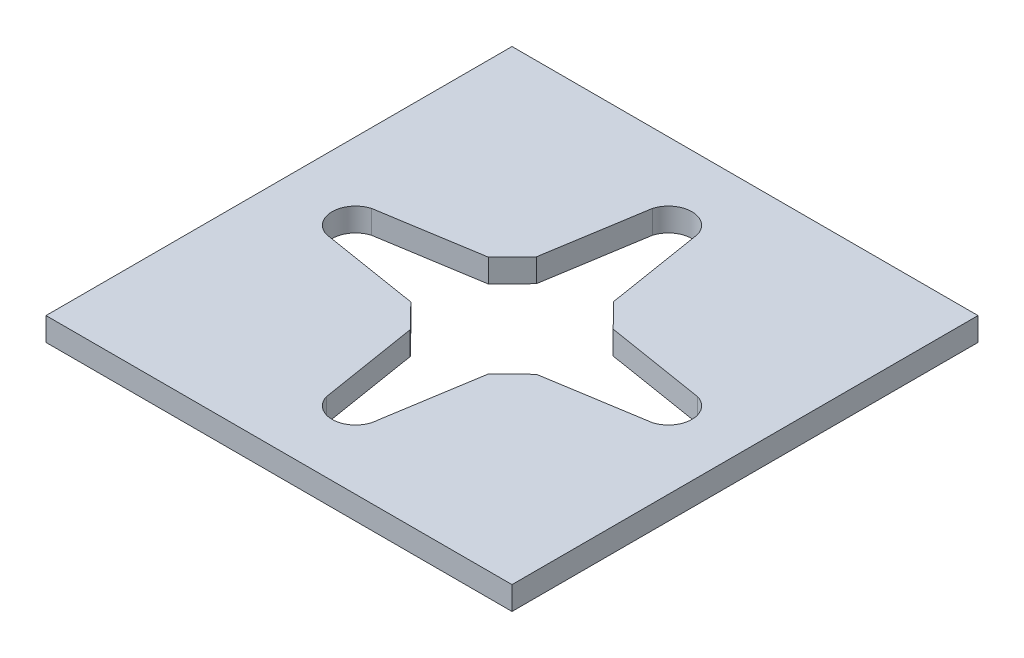
ISO-10303-21;
HEADER;
FILE_DESCRIPTION(('STEP AP214'),'2;1');
FILE_NAME('part.step','',(''),(''),'','','');
FILE_SCHEMA(('AUTOMOTIVE_DESIGN { 1 0 10303 214 1 1 1 1 }'));
ENDSEC;
DATA;
#1=APPLICATION_CONTEXT('core data for automotive mechanical design processes');
#2=APPLICATION_PROTOCOL_DEFINITION('international standard','automotive_design',2000,#1);
#3=PRODUCT_CONTEXT('',#1,'mechanical');
#4=PRODUCT('Part','Part','',(#3));
#5=PRODUCT_RELATED_PRODUCT_CATEGORY('part','',(#4));
#6=PRODUCT_DEFINITION_FORMATION('','',#4);
#7=PRODUCT_DEFINITION_CONTEXT('part definition',#1,'design');
#8=PRODUCT_DEFINITION('design','',#6,#7);
#9=PRODUCT_DEFINITION_SHAPE('','',#8);
#10=(LENGTH_UNIT() NAMED_UNIT(*) SI_UNIT(.MILLI.,.METRE.));
#11=(NAMED_UNIT(*) PLANE_ANGLE_UNIT() SI_UNIT($,.RADIAN.));
#12=(NAMED_UNIT(*) SI_UNIT($,.STERADIAN.) SOLID_ANGLE_UNIT());
#13=UNCERTAINTY_MEASURE_WITH_UNIT(LENGTH_MEASURE(1.E-05),#10,'distance_accuracy_value','');
#14=(GEOMETRIC_REPRESENTATION_CONTEXT(3) GLOBAL_UNCERTAINTY_ASSIGNED_CONTEXT((#13)) GLOBAL_UNIT_ASSIGNED_CONTEXT((#10,
#11,#12)) REPRESENTATION_CONTEXT('',''));
#15=CARTESIAN_POINT('',(0.,0.,0.));
#16=DIRECTION('',(0.,0.,1.));
#17=DIRECTION('',(1.,0.,0.));
#18=AXIS2_PLACEMENT_3D('',#15,#16,#17);
#19=CARTESIAN_POINT('',(25.4,2.54,25.4));
#20=DIRECTION('',(-1.,0.,0.));
#21=DIRECTION('',(0.,0.,1.));
#22=AXIS2_PLACEMENT_3D('',#19,#20,#21);
#23=PLANE('',#22);
#24=DIRECTION('',(0.,0.,-1.));
#25=VECTOR('',#24,1.);
#26=CARTESIAN_POINT('',(25.4,0.,25.4));
#27=LINE('',#26,#25);
#28=CARTESIAN_POINT('',(25.4,0.,25.4));
#29=VERTEX_POINT('',#28);
#30=CARTESIAN_POINT('',(25.4,0.,-25.4));
#31=VERTEX_POINT('',#30);
#32=EDGE_CURVE('E269',#29,#31,#27,.T.);
#33=ORIENTED_EDGE('',*,*,#32,.T.);
#34=DIRECTION('',(0.,-1.,0.));
#35=VECTOR('',#34,1.);
#36=CARTESIAN_POINT('',(25.4,2.54,-25.4));
#37=LINE('',#36,#35);
#38=CARTESIAN_POINT('',(25.4,2.54,-25.4));
#39=VERTEX_POINT('',#38);
#40=EDGE_CURVE('E11',#39,#31,#37,.T.);
#41=ORIENTED_EDGE('',*,*,#40,.F.);
#42=DIRECTION('',(0.,0.,-1.));
#43=VECTOR('',#42,1.);
#44=CARTESIAN_POINT('',(25.4,2.54,25.4));
#45=LINE('',#44,#43);
#46=CARTESIAN_POINT('',(25.4,2.54,25.4));
#47=VERTEX_POINT('',#46);
#48=EDGE_CURVE('E297',#47,#39,#45,.T.);
#49=ORIENTED_EDGE('',*,*,#48,.F.);
#50=DIRECTION('',(0.,-1.,0.));
#51=VECTOR('',#50,1.);
#52=CARTESIAN_POINT('',(25.4,2.54,25.4));
#53=LINE('',#52,#51);
#54=EDGE_CURVE('E307',#47,#29,#53,.T.);
#55=ORIENTED_EDGE('',*,*,#54,.T.);
#56=EDGE_LOOP('',(#33,#41,#49,#55));
#57=FACE_BOUND('',#56,.T.);
#58=ADVANCED_FACE('F34',(#57),#23,.F.);
#59=CARTESIAN_POINT('',(-25.4,2.54,-25.4));
#60=DIRECTION('',(0.,0.,1.));
#61=DIRECTION('',(1.,0.,0.));
#62=AXIS2_PLACEMENT_3D('',#59,#60,#61);
#63=PLANE('',#62);
#64=DIRECTION('',(-1.,0.,0.));
#65=VECTOR('',#64,1.);
#66=CARTESIAN_POINT('',(-25.4,0.,-25.4));
#67=LINE('',#66,#65);
#68=CARTESIAN_POINT('',(-25.4,0.,-25.4));
#69=VERTEX_POINT('',#68);
#70=EDGE_CURVE('E310',#31,#69,#67,.T.);
#71=ORIENTED_EDGE('',*,*,#70,.T.);
#72=DIRECTION('',(0.,-1.,0.));
#73=VECTOR('',#72,1.);
#74=CARTESIAN_POINT('',(-25.4,2.54,-25.4));
#75=LINE('',#74,#73);
#76=CARTESIAN_POINT('',(-25.4,2.54,-25.4));
#77=VERTEX_POINT('',#76);
#78=EDGE_CURVE('E41',#77,#69,#75,.T.);
#79=ORIENTED_EDGE('',*,*,#78,.F.);
#80=DIRECTION('',(-1.,0.,0.));
#81=VECTOR('',#80,1.);
#82=CARTESIAN_POINT('',(-25.4,2.54,-25.4));
#83=LINE('',#82,#81);
#84=EDGE_CURVE('E300',#39,#77,#83,.T.);
#85=ORIENTED_EDGE('',*,*,#84,.F.);
#86=ORIENTED_EDGE('',*,*,#40,.T.);
#87=EDGE_LOOP('',(#71,#79,#85,#86));
#88=FACE_BOUND('',#87,.T.);
#89=ADVANCED_FACE('F338',(#88),#63,.F.);
#90=CARTESIAN_POINT('',(-25.4,2.54,25.4));
#91=DIRECTION('',(1.,0.,0.));
#92=DIRECTION('',(0.,0.,-1.));
#93=AXIS2_PLACEMENT_3D('',#90,#91,#92);
#94=PLANE('',#93);
#95=DIRECTION('',(0.,0.,1.));
#96=VECTOR('',#95,1.);
#97=CARTESIAN_POINT('',(-25.4,0.,25.4));
#98=LINE('',#97,#96);
#99=CARTESIAN_POINT('',(-25.4,0.,25.4));
#100=VERTEX_POINT('',#99);
#101=EDGE_CURVE('E312',#69,#100,#98,.T.);
#102=ORIENTED_EDGE('',*,*,#101,.T.);
#103=DIRECTION('',(0.,-1.,0.));
#104=VECTOR('',#103,1.);
#105=CARTESIAN_POINT('',(-25.4,2.54,25.4));
#106=LINE('',#105,#104);
#107=CARTESIAN_POINT('',(-25.4,2.54,25.4));
#108=VERTEX_POINT('',#107);
#109=EDGE_CURVE('E317',#108,#100,#106,.T.);
#110=ORIENTED_EDGE('',*,*,#109,.F.);
#111=DIRECTION('',(0.,0.,1.));
#112=VECTOR('',#111,1.);
#113=CARTESIAN_POINT('',(-25.4,2.54,25.4));
#114=LINE('',#113,#112);
#115=EDGE_CURVE('E303',#77,#108,#114,.T.);
#116=ORIENTED_EDGE('',*,*,#115,.F.);
#117=ORIENTED_EDGE('',*,*,#78,.T.);
#118=EDGE_LOOP('',(#102,#110,#116,#117));
#119=FACE_BOUND('',#118,.T.);
#120=ADVANCED_FACE('F324',(#119),#94,.F.);
#121=CARTESIAN_POINT('',(-25.4,2.54,25.4));
#122=DIRECTION('',(0.,0.,-1.));
#123=DIRECTION('',(-1.,0.,0.));
#124=AXIS2_PLACEMENT_3D('',#121,#122,#123);
#125=PLANE('',#124);
#126=DIRECTION('',(1.,0.,0.));
#127=VECTOR('',#126,1.);
#128=CARTESIAN_POINT('',(-25.4,0.,25.4));
#129=LINE('',#128,#127);
#130=EDGE_CURVE('E301',#100,#29,#129,.T.);
#131=ORIENTED_EDGE('',*,*,#130,.T.);
#132=ORIENTED_EDGE('',*,*,#54,.F.);
#133=DIRECTION('',(1.,0.,0.));
#134=VECTOR('',#133,1.);
#135=CARTESIAN_POINT('',(-25.4,2.54,25.4));
#136=LINE('',#135,#134);
#137=EDGE_CURVE('E305',#108,#47,#136,.T.);
#138=ORIENTED_EDGE('',*,*,#137,.F.);
#139=ORIENTED_EDGE('',*,*,#109,.T.);
#140=EDGE_LOOP('',(#131,#132,#138,#139));
#141=FACE_BOUND('',#140,.T.);
#142=ADVANCED_FACE('F333',(#141),#125,.F.);
#143=CARTESIAN_POINT('',(0.,2.54,0.));
#144=DIRECTION('',(0.,-1.,0.));
#145=DIRECTION('',(0.,0.,-1.));
#146=AXIS2_PLACEMENT_3D('',#143,#144,#145);
#147=PLANE('',#146);
#148=DIRECTION('',(0.159059701123281,0.,0.987268966127556));
#149=VECTOR('',#148,1.);
#150=CARTESIAN_POINT('',(-4.2146166189501,2.54,6.87754055348759));
#151=LINE('',#150,#149);
#152=CARTESIAN_POINT('',(-4.2146166189501,2.54,6.87754055348759));
#153=VERTEX_POINT('',#152);
#154=CARTESIAN_POINT('',(-2.46184494954487,2.54,17.7568334334004));
#155=VERTEX_POINT('',#154);
#156=EDGE_CURVE('E179',#153,#155,#151,.T.);
#157=ORIENTED_EDGE('',*,*,#156,.F.);
#158=DIRECTION('',(-0.698247442953113,0.,-0.715856485903033));
#159=VECTOR('',#158,1.);
#160=CARTESIAN_POINT('',(-4.2146166189501,2.54,6.87754055348759));
#161=LINE('',#160,#159);
#162=CARTESIAN_POINT('',(-6.79982336512669,2.54,4.22713769798433));
#163=VERTEX_POINT('',#162);
#164=EDGE_CURVE('E173',#153,#163,#161,.T.);
#165=ORIENTED_EDGE('',*,*,#164,.T.);
#166=DIRECTION('',(-0.987268966127555,0.,-0.159059701123284));
#167=VECTOR('',#166,1.);
#168=CARTESIAN_POINT('',(-6.79982336512669,2.54,4.22713769798433));
#169=LINE('',#168,#167);
#170=CARTESIAN_POINT('',(-17.7568334334004,2.54,2.46184494954473));
#171=VERTEX_POINT('',#170);
#172=EDGE_CURVE('E182',#163,#171,#169,.T.);
#173=ORIENTED_EDGE('',*,*,#172,.T.);
#174=CARTESIAN_POINT('',(-17.0514508816668,2.54,0.));
#175=DIRECTION('',(0.,-1.,0.));
#176=DIRECTION('',(0.,0.,-1.));
#177=AXIS2_PLACEMENT_3D('',#174,#175,#176);
#178=CIRCLE('',#177,2.5609070853682);
#179=CARTESIAN_POINT('',(-17.7568334334004,2.54,-2.46184494954474));
#180=VERTEX_POINT('',#179);
#181=EDGE_CURVE('E48',#171,#180,#178,.T.);
#182=ORIENTED_EDGE('',*,*,#181,.T.);
#183=DIRECTION('',(-0.987268966127555,0.,0.159059701123284));
#184=VECTOR('',#183,1.);
#185=CARTESIAN_POINT('',(-6.79982336512669,2.54,-4.22713769798433));
#186=LINE('',#185,#184);
#187=CARTESIAN_POINT('',(-6.79982336512669,2.54,-4.22713769798433));
#188=VERTEX_POINT('',#187);
#189=EDGE_CURVE('E196',#188,#180,#186,.T.);
#190=ORIENTED_EDGE('',*,*,#189,.F.);
#191=DIRECTION('',(0.698247442953232,0.,-0.715856485902917));
#192=VECTOR('',#191,1.);
#193=CARTESIAN_POINT('',(-6.79982336512669,2.54,-4.22713769798433));
#194=LINE('',#193,#192);
#195=CARTESIAN_POINT('',(-4.21461661895082,2.54,-6.87754055348598));
#196=VERTEX_POINT('',#195);
#197=EDGE_CURVE('E198',#188,#196,#194,.T.);
#198=ORIENTED_EDGE('',*,*,#197,.T.);
#199=DIRECTION('',(0.15905970112314,0.,-0.987268966127578));
#200=VECTOR('',#199,1.);
#201=CARTESIAN_POINT('',(-4.21461661895082,2.54,-6.87754055348598));
#202=LINE('',#201,#200);
#203=CARTESIAN_POINT('',(-2.46184494954694,2.54,-17.756833433399));
#204=VERTEX_POINT('',#203);
#205=EDGE_CURVE('E201',#196,#204,#202,.T.);
#206=ORIENTED_EDGE('',*,*,#205,.T.);
#207=CARTESIAN_POINT('',(-2.15060913565076E-12,2.54,-17.0514508816658));
#208=DIRECTION('',(0.,-1.,0.));
#209=DIRECTION('',(0.,0.,-1.));
#210=AXIS2_PLACEMENT_3D('',#207,#208,#209);
#211=CIRCLE('',#210,2.56090708536816);
#212=CARTESIAN_POINT('',(2.46184494954242,2.54,-17.7568334333998));
#213=VERTEX_POINT('',#212);
#214=EDGE_CURVE('E204',#204,#213,#211,.T.);
#215=ORIENTED_EDGE('',*,*,#214,.T.);
#216=DIRECTION('',(-0.159059701123438,0.,-0.98726896612753));
#217=VECTOR('',#216,1.);
#218=CARTESIAN_POINT('',(4.21461661894958,2.54,-6.87754055348723));
#219=LINE('',#218,#217);
#220=CARTESIAN_POINT('',(4.21461661894958,2.54,-6.87754055348723));
#221=VERTEX_POINT('',#220);
#222=EDGE_CURVE('E207',#221,#213,#219,.T.);
#223=ORIENTED_EDGE('',*,*,#222,.F.);
#224=DIRECTION('',(-0.698247442953113,0.,-0.715856485903033));
#225=VECTOR('',#224,1.);
#226=CARTESIAN_POINT('',(6.79982336512564,2.54,-4.22713769798451));
#227=LINE('',#226,#225);
#228=CARTESIAN_POINT('',(6.79982336512564,2.54,-4.22713769798451));
#229=VERTEX_POINT('',#228);
#230=EDGE_CURVE('E209',#229,#221,#227,.T.);
#231=ORIENTED_EDGE('',*,*,#230,.F.);
#232=DIRECTION('',(0.987268966127582,0.,0.159059701123118));
#233=VECTOR('',#232,1.);
#234=CARTESIAN_POINT('',(6.79982336512564,2.54,-4.22713769798451));
#235=LINE('',#234,#233);
#236=CARTESIAN_POINT('',(17.7568334333996,2.54,-2.46184494954675));
#237=VERTEX_POINT('',#236);
#238=EDGE_CURVE('E211',#229,#237,#235,.T.);
#239=ORIENTED_EDGE('',*,*,#238,.T.);
#240=CARTESIAN_POINT('',(17.0514508816528,2.54,-5.60074017291797E-12));
#241=DIRECTION('',(0.,1.,0.));
#242=DIRECTION('',(0.,0.,1.));
#243=AXIS2_PLACEMENT_3D('',#240,#241,#242);
#244=CIRCLE('',#243,2.56090708536853);
#245=CARTESIAN_POINT('',(17.7568334333989,2.54,2.46184494953587));
#246=VERTEX_POINT('',#245);
#247=EDGE_CURVE('E214',#246,#237,#244,.T.);
#248=ORIENTED_EDGE('',*,*,#247,.F.);
#249=DIRECTION('',(0.987268966127428,0.,-0.159059701124071));
#250=VECTOR('',#249,1.);
#251=CARTESIAN_POINT('',(6.87754055348766,2.54,4.21461661895008));
#252=LINE('',#251,#250);
#253=CARTESIAN_POINT('',(6.87754055348766,2.54,4.21461661895008));
#254=VERTEX_POINT('',#253);
#255=EDGE_CURVE('E216',#254,#246,#252,.T.);
#256=ORIENTED_EDGE('',*,*,#255,.F.);
#257=DIRECTION('',(0.715856485903032,0.,-0.698247442953114));
#258=VECTOR('',#257,1.);
#259=CARTESIAN_POINT('',(4.2271376979843,2.54,6.79982336512676));
#260=LINE('',#259,#258);
#261=CARTESIAN_POINT('',(4.2271376979843,2.54,6.79982336512676));
#262=VERTEX_POINT('',#261);
#263=EDGE_CURVE('E218',#262,#254,#260,.T.);
#264=ORIENTED_EDGE('',*,*,#263,.F.);
#265=DIRECTION('',(-0.159059701123261,0.,0.987268966127559));
#266=VECTOR('',#265,1.);
#267=CARTESIAN_POINT('',(4.2271376979843,2.54,6.79982336512676));
#268=LINE('',#267,#266);
#269=CARTESIAN_POINT('',(2.55881473583303,2.54,17.154950869947));
#270=VERTEX_POINT('',#269);
#271=EDGE_CURVE('E220',#262,#270,#268,.T.);
#272=ORIENTED_EDGE('',*,*,#271,.T.);
#273=CARTESIAN_POINT('',(0.,2.54,17.0514508816668));
#274=DIRECTION('',(0.,1.,0.));
#275=DIRECTION('',(0.,0.,1.));
#276=AXIS2_PLACEMENT_3D('',#273,#274,#275);
#277=CIRCLE('',#276,2.56090708536849);
#278=EDGE_CURVE('E223',#155,#270,#277,.T.);
#279=ORIENTED_EDGE('',*,*,#278,.F.);
#280=EDGE_LOOP('',(#157,#165,#173,#182,#190,#198,#206,#215,#223,#231,#239,#248,#256,#264,#272,#279));
#281=FACE_BOUND('',#280,.T.);
#282=ORIENTED_EDGE('',*,*,#48,.T.);
#283=ORIENTED_EDGE('',*,*,#84,.T.);
#284=ORIENTED_EDGE('',*,*,#115,.T.);
#285=ORIENTED_EDGE('',*,*,#137,.T.);
#286=EDGE_LOOP('',(#282,#283,#284,#285));
#287=FACE_BOUND('',#286,.T.);
#288=ADVANCED_FACE('F186',(#281,#287),#147,.F.);
#289=CARTESIAN_POINT('',(0.,0.,0.));
#290=DIRECTION('',(0.,-1.,0.));
#291=DIRECTION('',(0.,0.,-1.));
#292=AXIS2_PLACEMENT_3D('',#289,#290,#291);
#293=PLANE('',#292);
#294=DIRECTION('',(-0.698247442953113,0.,-0.715856485903033));
#295=VECTOR('',#294,1.);
#296=CARTESIAN_POINT('',(-4.2146166189501,0.,6.87754055348759));
#297=LINE('',#296,#295);
#298=CARTESIAN_POINT('',(-4.2146166189501,0.,6.87754055348759));
#299=VERTEX_POINT('',#298);
#300=CARTESIAN_POINT('',(-6.79982336512669,0.,4.22713769798433));
#301=VERTEX_POINT('',#300);
#302=EDGE_CURVE('E56',#299,#301,#297,.T.);
#303=ORIENTED_EDGE('',*,*,#302,.F.);
#304=DIRECTION('',(0.159059701123281,0.,0.987268966127556));
#305=VECTOR('',#304,1.);
#306=CARTESIAN_POINT('',(-4.2146166189501,0.,6.87754055348759));
#307=LINE('',#306,#305);
#308=CARTESIAN_POINT('',(-2.46184494954487,0.,17.7568334334004));
#309=VERTEX_POINT('',#308);
#310=EDGE_CURVE('E189',#299,#309,#307,.T.);
#311=ORIENTED_EDGE('',*,*,#310,.T.);
#312=CARTESIAN_POINT('',(0.,0.,17.0514508816668));
#313=DIRECTION('',(0.,-1.,0.));
#314=DIRECTION('',(0.,0.,-1.));
#315=AXIS2_PLACEMENT_3D('',#312,#313,#314);
#316=CIRCLE('',#315,2.56090708536829);
#317=CARTESIAN_POINT('',(2.55881473583303,0.,17.154950869947));
#318=VERTEX_POINT('',#317);
#319=EDGE_CURVE('E192',#318,#309,#316,.T.);
#320=ORIENTED_EDGE('',*,*,#319,.F.);
#321=DIRECTION('',(-0.159059701123261,0.,0.987268966127559));
#322=VECTOR('',#321,1.);
#323=CARTESIAN_POINT('',(4.2271376979843,0.,6.79982336512676));
#324=LINE('',#323,#322);
#325=CARTESIAN_POINT('',(4.2271376979843,0.,6.79982336512676));
#326=VERTEX_POINT('',#325);
#327=EDGE_CURVE('E262',#326,#318,#324,.T.);
#328=ORIENTED_EDGE('',*,*,#327,.F.);
#329=DIRECTION('',(0.715856485903032,0.,-0.698247442953114));
#330=VECTOR('',#329,1.);
#331=CARTESIAN_POINT('',(4.2271376979843,0.,6.79982336512676));
#332=LINE('',#331,#330);
#333=CARTESIAN_POINT('',(6.87754055348766,0.,4.21461661895008));
#334=VERTEX_POINT('',#333);
#335=EDGE_CURVE('E259',#326,#334,#332,.T.);
#336=ORIENTED_EDGE('',*,*,#335,.T.);
#337=DIRECTION('',(0.987268966127428,0.,-0.159059701124071));
#338=VECTOR('',#337,1.);
#339=CARTESIAN_POINT('',(6.87754055348766,0.,4.21461661895008));
#340=LINE('',#339,#338);
#341=CARTESIAN_POINT('',(17.7568334333989,0.,2.46184494953587));
#342=VERTEX_POINT('',#341);
#343=EDGE_CURVE('E256',#334,#342,#340,.T.);
#344=ORIENTED_EDGE('',*,*,#343,.T.);
#345=CARTESIAN_POINT('',(17.0514508816528,0.,-5.60074017291797E-12));
#346=DIRECTION('',(0.,1.,0.));
#347=DIRECTION('',(0.,0.,1.));
#348=AXIS2_PLACEMENT_3D('',#345,#346,#347);
#349=CIRCLE('',#348,2.56090708536853);
#350=CARTESIAN_POINT('',(17.7568334333996,0.,-2.46184494954675));
#351=VERTEX_POINT('',#350);
#352=EDGE_CURVE('E253',#342,#351,#349,.T.);
#353=ORIENTED_EDGE('',*,*,#352,.T.);
#354=DIRECTION('',(0.987268966127582,0.,0.159059701123118));
#355=VECTOR('',#354,1.);
#356=CARTESIAN_POINT('',(6.79982336512564,0.,-4.22713769798451));
#357=LINE('',#356,#355);
#358=CARTESIAN_POINT('',(6.79982336512564,0.,-4.22713769798451));
#359=VERTEX_POINT('',#358);
#360=EDGE_CURVE('E250',#359,#351,#357,.T.);
#361=ORIENTED_EDGE('',*,*,#360,.F.);
#362=DIRECTION('',(-0.698247442953113,0.,-0.715856485903033));
#363=VECTOR('',#362,1.);
#364=CARTESIAN_POINT('',(6.79982336512564,0.,-4.22713769798451));
#365=LINE('',#364,#363);
#366=CARTESIAN_POINT('',(4.21461661894958,0.,-6.87754055348723));
#367=VERTEX_POINT('',#366);
#368=EDGE_CURVE('E247',#359,#367,#365,.T.);
#369=ORIENTED_EDGE('',*,*,#368,.T.);
#370=DIRECTION('',(-0.159059701123438,0.,-0.98726896612753));
#371=VECTOR('',#370,1.);
#372=CARTESIAN_POINT('',(4.21461661894958,0.,-6.87754055348723));
#373=LINE('',#372,#371);
#374=CARTESIAN_POINT('',(2.46184494954242,0.,-17.7568334333998));
#375=VERTEX_POINT('',#374);
#376=EDGE_CURVE('E244',#367,#375,#373,.T.);
#377=ORIENTED_EDGE('',*,*,#376,.T.);
#378=CARTESIAN_POINT('',(-2.15060913565076E-12,0.,-17.0514508816658));
#379=DIRECTION('',(0.,-1.,0.));
#380=DIRECTION('',(0.,0.,-1.));
#381=AXIS2_PLACEMENT_3D('',#378,#379,#380);
#382=CIRCLE('',#381,2.56090708536816);
#383=CARTESIAN_POINT('',(-2.46184494954694,0.,-17.756833433399));
#384=VERTEX_POINT('',#383);
#385=EDGE_CURVE('E241',#384,#375,#382,.T.);
#386=ORIENTED_EDGE('',*,*,#385,.F.);
#387=DIRECTION('',(0.15905970112314,0.,-0.987268966127578));
#388=VECTOR('',#387,1.);
#389=CARTESIAN_POINT('',(-4.21461661895082,0.,-6.87754055348598));
#390=LINE('',#389,#388);
#391=CARTESIAN_POINT('',(-4.21461661895082,0.,-6.87754055348598));
#392=VERTEX_POINT('',#391);
#393=EDGE_CURVE('E238',#392,#384,#390,.T.);
#394=ORIENTED_EDGE('',*,*,#393,.F.);
#395=DIRECTION('',(0.698247442953232,0.,-0.715856485902917));
#396=VECTOR('',#395,1.);
#397=CARTESIAN_POINT('',(-6.79982336512669,0.,-4.22713769798433));
#398=LINE('',#397,#396);
#399=CARTESIAN_POINT('',(-6.79982336512669,0.,-4.22713769798433));
#400=VERTEX_POINT('',#399);
#401=EDGE_CURVE('E235',#400,#392,#398,.T.);
#402=ORIENTED_EDGE('',*,*,#401,.F.);
#403=DIRECTION('',(-0.987268966127555,0.,0.159059701123284));
#404=VECTOR('',#403,1.);
#405=CARTESIAN_POINT('',(-6.79982336512669,0.,-4.22713769798433));
#406=LINE('',#405,#404);
#407=CARTESIAN_POINT('',(-17.7568334334004,0.,-2.46184494954474));
#408=VERTEX_POINT('',#407);
#409=EDGE_CURVE('E232',#400,#408,#406,.T.);
#410=ORIENTED_EDGE('',*,*,#409,.T.);
#411=CARTESIAN_POINT('',(-17.0514508816668,0.,0.));
#412=DIRECTION('',(0.,-1.,0.));
#413=DIRECTION('',(0.,0.,-1.));
#414=AXIS2_PLACEMENT_3D('',#411,#412,#413);
#415=CIRCLE('',#414,2.5609070853682);
#416=CARTESIAN_POINT('',(-17.7568334334004,0.,2.46184494954473));
#417=VERTEX_POINT('',#416);
#418=EDGE_CURVE('E229',#417,#408,#415,.T.);
#419=ORIENTED_EDGE('',*,*,#418,.F.);
#420=DIRECTION('',(-0.987268966127555,0.,-0.159059701123284));
#421=VECTOR('',#420,1.);
#422=CARTESIAN_POINT('',(-6.79982336512669,0.,4.22713769798433));
#423=LINE('',#422,#421);
#424=EDGE_CURVE('E227',#301,#417,#423,.T.);
#425=ORIENTED_EDGE('',*,*,#424,.F.);
#426=EDGE_LOOP('',(#303,#311,#320,#328,#336,#344,#353,#361,#369,#377,#386,#394,#402,#410,#419,#425));
#427=FACE_BOUND('',#426,.T.);
#428=ORIENTED_EDGE('',*,*,#32,.F.);
#429=ORIENTED_EDGE('',*,*,#130,.F.);
#430=ORIENTED_EDGE('',*,*,#101,.F.);
#431=ORIENTED_EDGE('',*,*,#70,.F.);
#432=EDGE_LOOP('',(#428,#429,#430,#431));
#433=FACE_BOUND('',#432,.T.);
#434=ADVANCED_FACE('F330',(#427,#433),#293,.T.);
#435=CARTESIAN_POINT('',(-4.2146166189501,2.54,6.87754055348759));
#436=DIRECTION('',(-0.715856485903033,0.,0.698247442953113));
#437=DIRECTION('',(0.698247442953113,0.,0.715856485903033));
#438=AXIS2_PLACEMENT_3D('',#435,#436,#437);
#439=PLANE('',#438);
#440=ORIENTED_EDGE('',*,*,#302,.T.);
#441=DIRECTION('',(0.,-1.,0.));
#442=VECTOR('',#441,1.);
#443=CARTESIAN_POINT('',(-6.79982336512669,2.54,4.22713769798433));
#444=LINE('',#443,#442);
#445=EDGE_CURVE('E169',#163,#301,#444,.T.);
#446=ORIENTED_EDGE('',*,*,#445,.F.);
#447=ORIENTED_EDGE('',*,*,#164,.F.);
#448=DIRECTION('',(0.,-1.,0.));
#449=VECTOR('',#448,1.);
#450=CARTESIAN_POINT('',(-4.2146166189501,2.54,6.87754055348759));
#451=LINE('',#450,#449);
#452=EDGE_CURVE('E267',#153,#299,#451,.T.);
#453=ORIENTED_EDGE('',*,*,#452,.T.);
#454=EDGE_LOOP('',(#440,#446,#447,#453));
#455=FACE_BOUND('',#454,.T.);
#456=ADVANCED_FACE('F171',(#455),#439,.F.);
#457=CARTESIAN_POINT('',(-4.2146166189501,2.54,6.87754055348759));
#458=DIRECTION('',(0.987268966127556,0.,-0.159059701123281));
#459=DIRECTION('',(-0.159059701123281,0.,-0.987268966127556));
#460=AXIS2_PLACEMENT_3D('',#457,#458,#459);
#461=PLANE('',#460);
#462=ORIENTED_EDGE('',*,*,#310,.F.);
#463=ORIENTED_EDGE('',*,*,#452,.F.);
#464=ORIENTED_EDGE('',*,*,#156,.T.);
#465=DIRECTION('',(0.,-1.,0.));
#466=VECTOR('',#465,1.);
#467=CARTESIAN_POINT('',(-2.46184494954487,2.54,17.7568334334004));
#468=LINE('',#467,#466);
#469=EDGE_CURVE('E270',#155,#309,#468,.T.);
#470=ORIENTED_EDGE('',*,*,#469,.T.);
#471=EDGE_LOOP('',(#462,#463,#464,#470));
#472=FACE_BOUND('',#471,.T.);
#473=ADVANCED_FACE('F355',(#472),#461,.T.);
#474=CARTESIAN_POINT('',(0.,2.54,17.0514508816668));
#475=DIRECTION('',(0.,-1.,0.));
#476=DIRECTION('',(0.,0.,-1.));
#477=AXIS2_PLACEMENT_3D('',#474,#475,#476);
#478=CYLINDRICAL_SURFACE('',#477,2.56090708536829);
#479=ORIENTED_EDGE('',*,*,#319,.T.);
#480=ORIENTED_EDGE('',*,*,#469,.F.);
#481=ORIENTED_EDGE('',*,*,#278,.T.);
#482=DIRECTION('',(0.,-1.,0.));
#483=VECTOR('',#482,1.);
#484=CARTESIAN_POINT('',(2.55881473583303,2.54,17.154950869947));
#485=LINE('',#484,#483);
#486=EDGE_CURVE('E272',#270,#318,#485,.T.);
#487=ORIENTED_EDGE('',*,*,#486,.T.);
#488=EDGE_LOOP('',(#479,#480,#481,#487));
#489=FACE_BOUND('',#488,.T.);
#490=ADVANCED_FACE('F404',(#489),#478,.F.);
#491=CARTESIAN_POINT('',(4.2271376979843,2.54,6.79982336512676));
#492=DIRECTION('',(0.987268966127559,0.,0.159059701123261));
#493=DIRECTION('',(0.159059701123261,0.,-0.987268966127559));
#494=AXIS2_PLACEMENT_3D('',#491,#492,#493);
#495=PLANE('',#494);
#496=ORIENTED_EDGE('',*,*,#327,.T.);
#497=ORIENTED_EDGE('',*,*,#486,.F.);
#498=ORIENTED_EDGE('',*,*,#271,.F.);
#499=DIRECTION('',(0.,-1.,0.));
#500=VECTOR('',#499,1.);
#501=CARTESIAN_POINT('',(4.2271376979843,2.54,6.79982336512676));
#502=LINE('',#501,#500);
#503=EDGE_CURVE('E274',#262,#326,#502,.T.);
#504=ORIENTED_EDGE('',*,*,#503,.T.);
#505=EDGE_LOOP('',(#496,#497,#498,#504));
#506=FACE_BOUND('',#505,.T.);
#507=ADVANCED_FACE('F400',(#506),#495,.F.);
#508=CARTESIAN_POINT('',(4.2271376979843,2.54,6.79982336512676));
#509=DIRECTION('',(-0.698247442953114,0.,-0.715856485903032));
#510=DIRECTION('',(-0.715856485903032,0.,0.698247442953114));
#511=AXIS2_PLACEMENT_3D('',#508,#509,#510);
#512=PLANE('',#511);
#513=ORIENTED_EDGE('',*,*,#335,.F.);
#514=ORIENTED_EDGE('',*,*,#503,.F.);
#515=ORIENTED_EDGE('',*,*,#263,.T.);
#516=DIRECTION('',(0.,-1.,0.));
#517=VECTOR('',#516,1.);
#518=CARTESIAN_POINT('',(6.87754055348766,2.54,4.21461661895008));
#519=LINE('',#518,#517);
#520=EDGE_CURVE('E276',#254,#334,#519,.T.);
#521=ORIENTED_EDGE('',*,*,#520,.T.);
#522=EDGE_LOOP('',(#513,#514,#515,#521));
#523=FACE_BOUND('',#522,.T.);
#524=ADVANCED_FACE('F396',(#523),#512,.T.);
#525=CARTESIAN_POINT('',(6.87754055348766,2.54,4.21461661895008));
#526=DIRECTION('',(-0.159059701124071,0.,-0.987268966127428));
#527=DIRECTION('',(-0.987268966127428,0.,0.159059701124071));
#528=AXIS2_PLACEMENT_3D('',#525,#526,#527);
#529=PLANE('',#528);
#530=ORIENTED_EDGE('',*,*,#343,.F.);
#531=ORIENTED_EDGE('',*,*,#520,.F.);
#532=ORIENTED_EDGE('',*,*,#255,.T.);
#533=DIRECTION('',(0.,-1.,0.));
#534=VECTOR('',#533,1.);
#535=CARTESIAN_POINT('',(17.7568334333989,2.54,2.46184494953587));
#536=LINE('',#535,#534);
#537=EDGE_CURVE('E278',#246,#342,#536,.T.);
#538=ORIENTED_EDGE('',*,*,#537,.T.);
#539=EDGE_LOOP('',(#530,#531,#532,#538));
#540=FACE_BOUND('',#539,.T.);
#541=ADVANCED_FACE('F392',(#540),#529,.T.);
#542=CARTESIAN_POINT('',(17.0514508816528,2.54,-5.60074017291797E-12));
#543=DIRECTION('',(0.,-1.,0.));
#544=DIRECTION('',(0.,0.,-1.));
#545=AXIS2_PLACEMENT_3D('',#542,#543,#544);
#546=CYLINDRICAL_SURFACE('',#545,2.56090708536853);
#547=ORIENTED_EDGE('',*,*,#352,.F.);
#548=ORIENTED_EDGE('',*,*,#537,.F.);
#549=ORIENTED_EDGE('',*,*,#247,.T.);
#550=DIRECTION('',(0.,-1.,0.));
#551=VECTOR('',#550,1.);
#552=CARTESIAN_POINT('',(17.7568334333996,2.54,-2.46184494954675));
#553=LINE('',#552,#551);
#554=EDGE_CURVE('E280',#237,#351,#553,.T.);
#555=ORIENTED_EDGE('',*,*,#554,.T.);
#556=EDGE_LOOP('',(#547,#548,#549,#555));
#557=FACE_BOUND('',#556,.T.);
#558=ADVANCED_FACE('F388',(#557),#546,.F.);
#559=CARTESIAN_POINT('',(6.79982336512564,2.54,-4.22713769798451));
#560=DIRECTION('',(0.159059701123118,0.,-0.987268966127582));
#561=DIRECTION('',(-0.987268966127582,0.,-0.159059701123118));
#562=AXIS2_PLACEMENT_3D('',#559,#560,#561);
#563=PLANE('',#562);
#564=ORIENTED_EDGE('',*,*,#360,.T.);
#565=ORIENTED_EDGE('',*,*,#554,.F.);
#566=ORIENTED_EDGE('',*,*,#238,.F.);
#567=DIRECTION('',(0.,-1.,0.));
#568=VECTOR('',#567,1.);
#569=CARTESIAN_POINT('',(6.79982336512564,2.54,-4.22713769798451));
#570=LINE('',#569,#568);
#571=EDGE_CURVE('E282',#229,#359,#570,.T.);
#572=ORIENTED_EDGE('',*,*,#571,.T.);
#573=EDGE_LOOP('',(#564,#565,#566,#572));
#574=FACE_BOUND('',#573,.T.);
#575=ADVANCED_FACE('F384',(#574),#563,.F.);
#576=CARTESIAN_POINT('',(6.79982336512564,2.54,-4.22713769798451));
#577=DIRECTION('',(-0.715856485903033,0.,0.698247442953113));
#578=DIRECTION('',(0.698247442953113,0.,0.715856485903033));
#579=AXIS2_PLACEMENT_3D('',#576,#577,#578);
#580=PLANE('',#579);
#581=ORIENTED_EDGE('',*,*,#368,.F.);
#582=ORIENTED_EDGE('',*,*,#571,.F.);
#583=ORIENTED_EDGE('',*,*,#230,.T.);
#584=DIRECTION('',(0.,-1.,0.));
#585=VECTOR('',#584,1.);
#586=CARTESIAN_POINT('',(4.21461661894958,2.54,-6.87754055348723));
#587=LINE('',#586,#585);
#588=EDGE_CURVE('E284',#221,#367,#587,.T.);
#589=ORIENTED_EDGE('',*,*,#588,.T.);
#590=EDGE_LOOP('',(#581,#582,#583,#589));
#591=FACE_BOUND('',#590,.T.);
#592=ADVANCED_FACE('F380',(#591),#580,.T.);
#593=CARTESIAN_POINT('',(4.21461661894958,2.54,-6.87754055348723));
#594=DIRECTION('',(-0.98726896612753,0.,0.159059701123438));
#595=DIRECTION('',(0.159059701123438,0.,0.98726896612753));
#596=AXIS2_PLACEMENT_3D('',#593,#594,#595);
#597=PLANE('',#596);
#598=ORIENTED_EDGE('',*,*,#376,.F.);
#599=ORIENTED_EDGE('',*,*,#588,.F.);
#600=ORIENTED_EDGE('',*,*,#222,.T.);
#601=DIRECTION('',(0.,-1.,0.));
#602=VECTOR('',#601,1.);
#603=CARTESIAN_POINT('',(2.46184494954242,2.54,-17.7568334333998));
#604=LINE('',#603,#602);
#605=EDGE_CURVE('E286',#213,#375,#604,.T.);
#606=ORIENTED_EDGE('',*,*,#605,.T.);
#607=EDGE_LOOP('',(#598,#599,#600,#606));
#608=FACE_BOUND('',#607,.T.);
#609=ADVANCED_FACE('F376',(#608),#597,.T.);
#610=CARTESIAN_POINT('',(-2.15060913565076E-12,2.54,-17.0514508816658));
#611=DIRECTION('',(0.,-1.,0.));
#612=DIRECTION('',(0.,0.,-1.));
#613=AXIS2_PLACEMENT_3D('',#610,#611,#612);
#614=CYLINDRICAL_SURFACE('',#613,2.56090708536816);
#615=ORIENTED_EDGE('',*,*,#385,.T.);
#616=ORIENTED_EDGE('',*,*,#605,.F.);
#617=ORIENTED_EDGE('',*,*,#214,.F.);
#618=DIRECTION('',(0.,-1.,0.));
#619=VECTOR('',#618,1.);
#620=CARTESIAN_POINT('',(-2.46184494954694,2.54,-17.756833433399));
#621=LINE('',#620,#619);
#622=EDGE_CURVE('E288',#204,#384,#621,.T.);
#623=ORIENTED_EDGE('',*,*,#622,.T.);
#624=EDGE_LOOP('',(#615,#616,#617,#623));
#625=FACE_BOUND('',#624,.T.);
#626=ADVANCED_FACE('F372',(#625),#614,.F.);
#627=CARTESIAN_POINT('',(-4.21461661895082,2.54,-6.87754055348598));
#628=DIRECTION('',(-0.987268966127578,0.,-0.15905970112314));
#629=DIRECTION('',(-0.15905970112314,0.,0.987268966127578));
#630=AXIS2_PLACEMENT_3D('',#627,#628,#629);
#631=PLANE('',#630);
#632=ORIENTED_EDGE('',*,*,#393,.T.);
#633=ORIENTED_EDGE('',*,*,#622,.F.);
#634=ORIENTED_EDGE('',*,*,#205,.F.);
#635=DIRECTION('',(0.,-1.,0.));
#636=VECTOR('',#635,1.);
#637=CARTESIAN_POINT('',(-4.21461661895082,2.54,-6.87754055348598));
#638=LINE('',#637,#636);
#639=EDGE_CURVE('E290',#196,#392,#638,.T.);
#640=ORIENTED_EDGE('',*,*,#639,.T.);
#641=EDGE_LOOP('',(#632,#633,#634,#640));
#642=FACE_BOUND('',#641,.T.);
#643=ADVANCED_FACE('F368',(#642),#631,.F.);
#644=CARTESIAN_POINT('',(-6.79982336512669,2.54,-4.22713769798433));
#645=DIRECTION('',(-0.715856485902917,0.,-0.698247442953232));
#646=DIRECTION('',(-0.698247442953232,0.,0.715856485902917));
#647=AXIS2_PLACEMENT_3D('',#644,#645,#646);
#648=PLANE('',#647);
#649=ORIENTED_EDGE('',*,*,#401,.T.);
#650=ORIENTED_EDGE('',*,*,#639,.F.);
#651=ORIENTED_EDGE('',*,*,#197,.F.);
#652=DIRECTION('',(0.,-1.,0.));
#653=VECTOR('',#652,1.);
#654=CARTESIAN_POINT('',(-6.79982336512669,2.54,-4.22713769798433));
#655=LINE('',#654,#653);
#656=EDGE_CURVE('E292',#188,#400,#655,.T.);
#657=ORIENTED_EDGE('',*,*,#656,.T.);
#658=EDGE_LOOP('',(#649,#650,#651,#657));
#659=FACE_BOUND('',#658,.T.);
#660=ADVANCED_FACE('F364',(#659),#648,.F.);
#661=CARTESIAN_POINT('',(-6.79982336512669,2.54,-4.22713769798433));
#662=DIRECTION('',(0.159059701123284,0.,0.987268966127555));
#663=DIRECTION('',(0.987268966127555,0.,-0.159059701123284));
#664=AXIS2_PLACEMENT_3D('',#661,#662,#663);
#665=PLANE('',#664);
#666=ORIENTED_EDGE('',*,*,#409,.F.);
#667=ORIENTED_EDGE('',*,*,#656,.F.);
#668=ORIENTED_EDGE('',*,*,#189,.T.);
#669=DIRECTION('',(0.,-1.,0.));
#670=VECTOR('',#669,1.);
#671=CARTESIAN_POINT('',(-17.7568334334004,2.54,-2.46184494954474));
#672=LINE('',#671,#670);
#673=EDGE_CURVE('E294',#180,#408,#672,.T.);
#674=ORIENTED_EDGE('',*,*,#673,.T.);
#675=EDGE_LOOP('',(#666,#667,#668,#674));
#676=FACE_BOUND('',#675,.T.);
#677=ADVANCED_FACE('F361',(#676),#665,.T.);
#678=CARTESIAN_POINT('',(-17.0514508816668,2.54,0.));
#679=DIRECTION('',(0.,-1.,0.));
#680=DIRECTION('',(0.,0.,-1.));
#681=AXIS2_PLACEMENT_3D('',#678,#679,#680);
#682=CYLINDRICAL_SURFACE('',#681,2.5609070853682);
#683=ORIENTED_EDGE('',*,*,#418,.T.);
#684=ORIENTED_EDGE('',*,*,#673,.F.);
#685=ORIENTED_EDGE('',*,*,#181,.F.);
#686=DIRECTION('',(0.,-1.,0.));
#687=VECTOR('',#686,1.);
#688=CARTESIAN_POINT('',(-17.7568334334004,2.54,2.46184494954473));
#689=LINE('',#688,#687);
#690=EDGE_CURVE('E178',#171,#417,#689,.T.);
#691=ORIENTED_EDGE('',*,*,#690,.T.);
#692=EDGE_LOOP('',(#683,#684,#685,#691));
#693=FACE_BOUND('',#692,.T.);
#694=ADVANCED_FACE('F358',(#693),#682,.F.);
#695=CARTESIAN_POINT('',(-6.79982336512669,2.54,4.22713769798433));
#696=DIRECTION('',(-0.159059701123284,0.,0.987268966127555));
#697=DIRECTION('',(0.987268966127555,0.,0.159059701123284));
#698=AXIS2_PLACEMENT_3D('',#695,#696,#697);
#699=PLANE('',#698);
#700=ORIENTED_EDGE('',*,*,#424,.T.);
#701=ORIENTED_EDGE('',*,*,#690,.F.);
#702=ORIENTED_EDGE('',*,*,#172,.F.);
#703=ORIENTED_EDGE('',*,*,#445,.T.);
#704=EDGE_LOOP('',(#700,#701,#702,#703));
#705=FACE_BOUND('',#704,.T.);
#706=ADVANCED_FACE('F183',(#705),#699,.F.);
#707=CLOSED_SHELL('',(#58,#89,#120,#142,#288,#434,#456,#473,#490,#507,#524,#541,#558,#575,#592,
#609,#626,#643,#660,#677,#694,#706));
#708=MANIFOLD_SOLID_BREP('B2',#707);
#709=ADVANCED_BREP_SHAPE_REPRESENTATION('',(#18,#708),#14);
#710=SHAPE_DEFINITION_REPRESENTATION(#9,#709);
ENDSEC;
END-ISO-10303-21;
